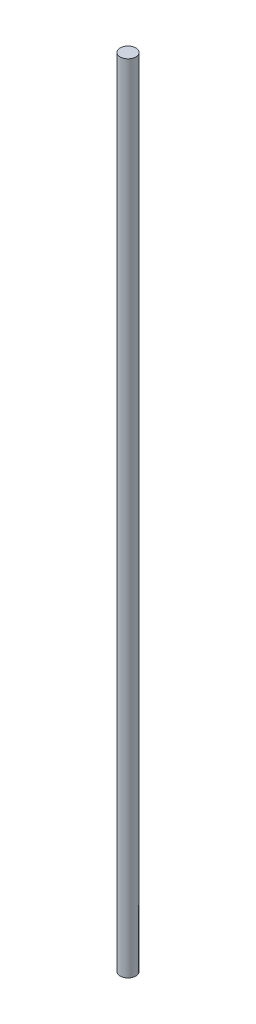
ISO-10303-21;
HEADER;
FILE_DESCRIPTION(('STEP AP214'),'2;1');
FILE_NAME('part.step','',(''),(''),'','','');
FILE_SCHEMA(('AUTOMOTIVE_DESIGN { 1 0 10303 214 1 1 1 1 }'));
ENDSEC;
DATA;
#1=APPLICATION_CONTEXT('core data for automotive mechanical design processes');
#2=APPLICATION_PROTOCOL_DEFINITION('international standard','automotive_design',2000,#1);
#3=PRODUCT_CONTEXT('',#1,'mechanical');
#4=PRODUCT('Part','Part','',(#3));
#5=PRODUCT_RELATED_PRODUCT_CATEGORY('part','',(#4));
#6=PRODUCT_DEFINITION_FORMATION('','',#4);
#7=PRODUCT_DEFINITION_CONTEXT('part definition',#1,'design');
#8=PRODUCT_DEFINITION('design','',#6,#7);
#9=PRODUCT_DEFINITION_SHAPE('','',#8);
#10=(LENGTH_UNIT() NAMED_UNIT(*) SI_UNIT(.MILLI.,.METRE.));
#11=(NAMED_UNIT(*) PLANE_ANGLE_UNIT() SI_UNIT($,.RADIAN.));
#12=(NAMED_UNIT(*) SI_UNIT($,.STERADIAN.) SOLID_ANGLE_UNIT());
#13=UNCERTAINTY_MEASURE_WITH_UNIT(LENGTH_MEASURE(1.E-05),#10,'distance_accuracy_value','');
#14=(GEOMETRIC_REPRESENTATION_CONTEXT(3) GLOBAL_UNCERTAINTY_ASSIGNED_CONTEXT((#13)) GLOBAL_UNIT_ASSIGNED_CONTEXT((#10,
#11,#12)) REPRESENTATION_CONTEXT('',''));
#15=CARTESIAN_POINT('',(0.,0.,0.));
#16=DIRECTION('',(0.,0.,1.));
#17=DIRECTION('',(1.,0.,0.));
#18=AXIS2_PLACEMENT_3D('',#15,#16,#17);
#19=CARTESIAN_POINT('',(0.,506.5,0.));
#20=DIRECTION('',(0.,-1.,0.));
#21=DIRECTION('',(0.,0.,-1.));
#22=AXIS2_PLACEMENT_3D('',#19,#20,#21);
#23=CYLINDRICAL_SURFACE('',#22,5.);
#24=CARTESIAN_POINT('',(0.,506.5,0.));
#25=DIRECTION('',(0.,1.,0.));
#26=DIRECTION('',(0.,0.,1.));
#27=AXIS2_PLACEMENT_3D('',#24,#25,#26);
#28=CIRCLE('',#27,5.);
#29=CARTESIAN_POINT('',(0.,506.5,5.));
#30=VERTEX_POINT('',#29);
#31=EDGE_CURVE('E10',#30,#30,#28,.T.);
#32=ORIENTED_EDGE('',*,*,#31,.F.);
#33=EDGE_LOOP('',(#32));
#34=FACE_BOUND('',#33,.T.);
#35=CARTESIAN_POINT('',(0.,0.,0.));
#36=DIRECTION('',(0.,1.,0.));
#37=DIRECTION('',(0.,0.,1.));
#38=AXIS2_PLACEMENT_3D('',#35,#36,#37);
#39=CIRCLE('',#38,5.);
#40=CARTESIAN_POINT('',(0.,0.,5.));
#41=VERTEX_POINT('',#40);
#42=EDGE_CURVE('E40',#41,#41,#39,.T.);
#43=ORIENTED_EDGE('',*,*,#42,.T.);
#44=EDGE_LOOP('',(#43));
#45=FACE_BOUND('',#44,.T.);
#46=ADVANCED_FACE('F37',(#34,#45),#23,.T.);
#47=CARTESIAN_POINT('',(0.,506.5,0.));
#48=DIRECTION('',(0.,1.,0.));
#49=DIRECTION('',(0.,0.,1.));
#50=AXIS2_PLACEMENT_3D('',#47,#48,#49);
#51=PLANE('',#50);
#52=ORIENTED_EDGE('',*,*,#31,.T.);
#53=EDGE_LOOP('',(#52));
#54=FACE_BOUND('',#53,.T.);
#55=ADVANCED_FACE('F54',(#54),#51,.T.);
#56=CARTESIAN_POINT('',(0.,0.,0.));
#57=DIRECTION('',(0.,1.,0.));
#58=DIRECTION('',(0.,0.,1.));
#59=AXIS2_PLACEMENT_3D('',#56,#57,#58);
#60=PLANE('',#59);
#61=ORIENTED_EDGE('',*,*,#42,.F.);
#62=EDGE_LOOP('',(#61));
#63=FACE_BOUND('',#62,.T.);
#64=ADVANCED_FACE('F52',(#63),#60,.F.);
#65=CLOSED_SHELL('',(#46,#55,#64));
#66=MANIFOLD_SOLID_BREP('B2',#65);
#67=ADVANCED_BREP_SHAPE_REPRESENTATION('',(#18,#66),#14);
#68=SHAPE_DEFINITION_REPRESENTATION(#9,#67);
ENDSEC;
END-ISO-10303-21;
